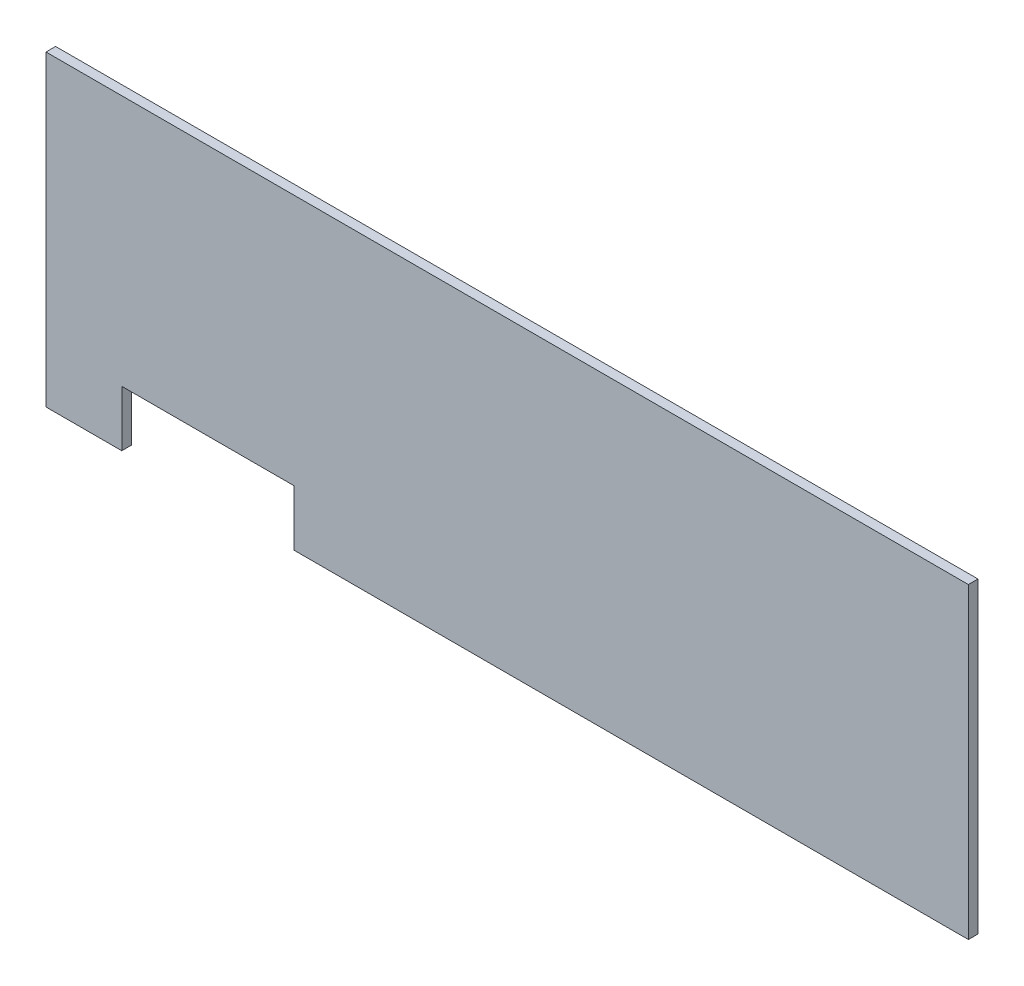
ISO-10303-21;
HEADER;
FILE_DESCRIPTION(('STEP AP214'),'2;1');
FILE_NAME('part.step','',(''),(''),'','','');
FILE_SCHEMA(('AUTOMOTIVE_DESIGN { 1 0 10303 214 1 1 1 1 }'));
ENDSEC;
DATA;
#1=APPLICATION_CONTEXT('core data for automotive mechanical design processes');
#2=APPLICATION_PROTOCOL_DEFINITION('international standard','automotive_design',2000,#1);
#3=PRODUCT_CONTEXT('',#1,'mechanical');
#4=PRODUCT('Part','Part','',(#3));
#5=PRODUCT_RELATED_PRODUCT_CATEGORY('part','',(#4));
#6=PRODUCT_DEFINITION_FORMATION('','',#4);
#7=PRODUCT_DEFINITION_CONTEXT('part definition',#1,'design');
#8=PRODUCT_DEFINITION('design','',#6,#7);
#9=PRODUCT_DEFINITION_SHAPE('','',#8);
#10=(LENGTH_UNIT() NAMED_UNIT(*) SI_UNIT(.MILLI.,.METRE.));
#11=(NAMED_UNIT(*) PLANE_ANGLE_UNIT() SI_UNIT($,.RADIAN.));
#12=(NAMED_UNIT(*) SI_UNIT($,.STERADIAN.) SOLID_ANGLE_UNIT());
#13=UNCERTAINTY_MEASURE_WITH_UNIT(LENGTH_MEASURE(1.E-05),#10,'distance_accuracy_value','');
#14=(GEOMETRIC_REPRESENTATION_CONTEXT(3) GLOBAL_UNCERTAINTY_ASSIGNED_CONTEXT((#13)) GLOBAL_UNIT_ASSIGNED_CONTEXT((#10,
#11,#12)) REPRESENTATION_CONTEXT('',''));
#15=CARTESIAN_POINT('',(0.,0.,0.));
#16=DIRECTION('',(0.,0.,1.));
#17=DIRECTION('',(1.,0.,0.));
#18=AXIS2_PLACEMENT_3D('',#15,#16,#17);
#19=CARTESIAN_POINT('',(152.4,-50.8,3.175));
#20=DIRECTION('',(-1.,0.,0.));
#21=DIRECTION('',(0.,0.,1.));
#22=AXIS2_PLACEMENT_3D('',#19,#20,#21);
#23=PLANE('',#22);
#24=DIRECTION('',(0.,1.,0.));
#25=VECTOR('',#24,1.);
#26=CARTESIAN_POINT('',(152.4,-50.8,0.));
#27=LINE('',#26,#25);
#28=CARTESIAN_POINT('',(152.4,-50.8,0.));
#29=VERTEX_POINT('',#28);
#30=CARTESIAN_POINT('',(152.4,50.8,0.));
#31=VERTEX_POINT('',#30);
#32=EDGE_CURVE('E129',#29,#31,#27,.T.);
#33=ORIENTED_EDGE('',*,*,#32,.T.);
#34=DIRECTION('',(0.,0.,-1.));
#35=VECTOR('',#34,1.);
#36=CARTESIAN_POINT('',(152.4,50.8,3.175));
#37=LINE('',#36,#35);
#38=CARTESIAN_POINT('',(152.4,50.8,3.175));
#39=VERTEX_POINT('',#38);
#40=EDGE_CURVE('E11',#39,#31,#37,.T.);
#41=ORIENTED_EDGE('',*,*,#40,.F.);
#42=DIRECTION('',(0.,1.,0.));
#43=VECTOR('',#42,1.);
#44=CARTESIAN_POINT('',(152.4,-50.8,3.175));
#45=LINE('',#44,#43);
#46=CARTESIAN_POINT('',(152.4,-50.8,3.175));
#47=VERTEX_POINT('',#46);
#48=EDGE_CURVE('E143',#47,#39,#45,.T.);
#49=ORIENTED_EDGE('',*,*,#48,.F.);
#50=DIRECTION('',(0.,0.,-1.));
#51=VECTOR('',#50,1.);
#52=CARTESIAN_POINT('',(152.4,-50.8,3.175));
#53=LINE('',#52,#51);
#54=EDGE_CURVE('E125',#47,#29,#53,.T.);
#55=ORIENTED_EDGE('',*,*,#54,.T.);
#56=EDGE_LOOP('',(#33,#41,#49,#55));
#57=FACE_BOUND('',#56,.T.);
#58=ADVANCED_FACE('F33',(#57),#23,.F.);
#59=CARTESIAN_POINT('',(-152.4,50.8,3.175));
#60=DIRECTION('',(0.,-1.,0.));
#61=DIRECTION('',(0.,0.,-1.));
#62=AXIS2_PLACEMENT_3D('',#59,#60,#61);
#63=PLANE('',#62);
#64=DIRECTION('',(-1.,0.,0.));
#65=VECTOR('',#64,1.);
#66=CARTESIAN_POINT('',(-152.4,50.8,0.));
#67=LINE('',#66,#65);
#68=CARTESIAN_POINT('',(-152.4,50.8,0.));
#69=VERTEX_POINT('',#68);
#70=EDGE_CURVE('E132',#31,#69,#67,.T.);
#71=ORIENTED_EDGE('',*,*,#70,.T.);
#72=DIRECTION('',(0.,0.,-1.));
#73=VECTOR('',#72,1.);
#74=CARTESIAN_POINT('',(-152.4,50.8,3.175));
#75=LINE('',#74,#73);
#76=CARTESIAN_POINT('',(-152.4,50.8,3.175));
#77=VERTEX_POINT('',#76);
#78=EDGE_CURVE('E41',#77,#69,#75,.T.);
#79=ORIENTED_EDGE('',*,*,#78,.F.);
#80=DIRECTION('',(-1.,0.,0.));
#81=VECTOR('',#80,1.);
#82=CARTESIAN_POINT('',(-152.4,50.8,3.175));
#83=LINE('',#82,#81);
#84=EDGE_CURVE('E92',#39,#77,#83,.T.);
#85=ORIENTED_EDGE('',*,*,#84,.F.);
#86=ORIENTED_EDGE('',*,*,#40,.T.);
#87=EDGE_LOOP('',(#71,#79,#85,#86));
#88=FACE_BOUND('',#87,.T.);
#89=ADVANCED_FACE('F178',(#88),#63,.F.);
#90=CARTESIAN_POINT('',(-152.4,-50.8,3.175));
#91=DIRECTION('',(1.,0.,0.));
#92=DIRECTION('',(0.,0.,-1.));
#93=AXIS2_PLACEMENT_3D('',#90,#91,#92);
#94=PLANE('',#93);
#95=DIRECTION('',(0.,-1.,0.));
#96=VECTOR('',#95,1.);
#97=CARTESIAN_POINT('',(-152.4,-50.8,0.));
#98=LINE('',#97,#96);
#99=CARTESIAN_POINT('',(-152.4,-50.8,0.));
#100=VERTEX_POINT('',#99);
#101=EDGE_CURVE('E134',#69,#100,#98,.T.);
#102=ORIENTED_EDGE('',*,*,#101,.T.);
#103=DIRECTION('',(0.,0.,-1.));
#104=VECTOR('',#103,1.);
#105=CARTESIAN_POINT('',(-152.4,-50.8,3.175));
#106=LINE('',#105,#104);
#107=CARTESIAN_POINT('',(-152.4,-50.8,3.175));
#108=VERTEX_POINT('',#107);
#109=EDGE_CURVE('E150',#108,#100,#106,.T.);
#110=ORIENTED_EDGE('',*,*,#109,.F.);
#111=DIRECTION('',(0.,-1.,0.));
#112=VECTOR('',#111,1.);
#113=CARTESIAN_POINT('',(-152.4,-50.8,3.175));
#114=LINE('',#113,#112);
#115=EDGE_CURVE('E158',#77,#108,#114,.T.);
#116=ORIENTED_EDGE('',*,*,#115,.F.);
#117=ORIENTED_EDGE('',*,*,#78,.T.);
#118=EDGE_LOOP('',(#102,#110,#116,#117));
#119=FACE_BOUND('',#118,.T.);
#120=ADVANCED_FACE('F156',(#119),#94,.F.);
#121=CARTESIAN_POINT('',(-152.4,-50.8,3.175));
#122=DIRECTION('',(0.,1.,0.));
#123=DIRECTION('',(0.,0.,1.));
#124=AXIS2_PLACEMENT_3D('',#121,#122,#123);
#125=PLANE('',#124);
#126=DIRECTION('',(1.,0.,0.));
#127=VECTOR('',#126,1.);
#128=CARTESIAN_POINT('',(-152.4,-50.8,0.));
#129=LINE('',#128,#127);
#130=CARTESIAN_POINT('',(-127.36284932908,-50.8,0.));
#131=VERTEX_POINT('',#130);
#132=EDGE_CURVE('E136',#100,#131,#129,.T.);
#133=ORIENTED_EDGE('',*,*,#132,.T.);
#134=DIRECTION('',(0.,0.,-1.));
#135=VECTOR('',#134,1.);
#136=CARTESIAN_POINT('',(-127.36284932908,-50.8,3.175));
#137=LINE('',#136,#135);
#138=CARTESIAN_POINT('',(-127.36284932908,-50.8,3.175));
#139=VERTEX_POINT('',#138);
#140=EDGE_CURVE('E147',#139,#131,#137,.T.);
#141=ORIENTED_EDGE('',*,*,#140,.F.);
#142=DIRECTION('',(1.,0.,0.));
#143=VECTOR('',#142,1.);
#144=CARTESIAN_POINT('',(-152.4,-50.8,3.175));
#145=LINE('',#144,#143);
#146=EDGE_CURVE('E170',#108,#139,#145,.T.);
#147=ORIENTED_EDGE('',*,*,#146,.F.);
#148=ORIENTED_EDGE('',*,*,#109,.T.);
#149=EDGE_LOOP('',(#133,#141,#147,#148));
#150=FACE_BOUND('',#149,.T.);
#151=ADVANCED_FACE('F166',(#150),#125,.F.);
#152=CARTESIAN_POINT('',(-127.36284932908,-50.8,3.175));
#153=DIRECTION('',(-1.,0.,0.));
#154=DIRECTION('',(0.,0.,1.));
#155=AXIS2_PLACEMENT_3D('',#152,#153,#154);
#156=PLANE('',#155);
#157=DIRECTION('',(0.,1.,0.));
#158=VECTOR('',#157,1.);
#159=CARTESIAN_POINT('',(-127.36284932908,-50.8,0.));
#160=LINE('',#159,#158);
#161=CARTESIAN_POINT('',(-127.36284932908,-32.348607659785,0.));
#162=VERTEX_POINT('',#161);
#163=EDGE_CURVE('E138',#131,#162,#160,.T.);
#164=ORIENTED_EDGE('',*,*,#163,.T.);
#165=DIRECTION('',(0.,0.,-1.));
#166=VECTOR('',#165,1.);
#167=CARTESIAN_POINT('',(-127.36284932908,-32.348607659785,3.175));
#168=LINE('',#167,#166);
#169=CARTESIAN_POINT('',(-127.36284932908,-32.348607659785,3.175));
#170=VERTEX_POINT('',#169);
#171=EDGE_CURVE('E120',#170,#162,#168,.T.);
#172=ORIENTED_EDGE('',*,*,#171,.F.);
#173=DIRECTION('',(0.,1.,0.));
#174=VECTOR('',#173,1.);
#175=CARTESIAN_POINT('',(-127.36284932908,-50.8,3.175));
#176=LINE('',#175,#174);
#177=EDGE_CURVE('E111',#139,#170,#176,.T.);
#178=ORIENTED_EDGE('',*,*,#177,.F.);
#179=ORIENTED_EDGE('',*,*,#140,.T.);
#180=EDGE_LOOP('',(#164,#172,#178,#179));
#181=FACE_BOUND('',#180,.T.);
#182=ADVANCED_FACE('F169',(#181),#156,.F.);
#183=CARTESIAN_POINT('',(-127.36284932908,-32.348607659785,3.175));
#184=DIRECTION('',(0.,1.,0.));
#185=DIRECTION('',(0.,0.,1.));
#186=AXIS2_PLACEMENT_3D('',#183,#184,#185);
#187=PLANE('',#186);
#188=DIRECTION('',(1.,0.,0.));
#189=VECTOR('',#188,1.);
#190=CARTESIAN_POINT('',(-127.36284932908,-32.348607659785,0.));
#191=LINE('',#190,#189);
#192=CARTESIAN_POINT('',(-70.4904972224677,-32.348607659785,0.));
#193=VERTEX_POINT('',#192);
#194=EDGE_CURVE('E119',#162,#193,#191,.T.);
#195=ORIENTED_EDGE('',*,*,#194,.T.);
#196=DIRECTION('',(0.,0.,-1.));
#197=VECTOR('',#196,1.);
#198=CARTESIAN_POINT('',(-70.4904972224677,-32.348607659785,3.175));
#199=LINE('',#198,#197);
#200=CARTESIAN_POINT('',(-70.4904972224677,-32.348607659785,3.175));
#201=VERTEX_POINT('',#200);
#202=EDGE_CURVE('E116',#201,#193,#199,.T.);
#203=ORIENTED_EDGE('',*,*,#202,.F.);
#204=DIRECTION('',(1.,0.,0.));
#205=VECTOR('',#204,1.);
#206=CARTESIAN_POINT('',(-127.36284932908,-32.348607659785,3.175));
#207=LINE('',#206,#205);
#208=EDGE_CURVE('E105',#170,#201,#207,.T.);
#209=ORIENTED_EDGE('',*,*,#208,.F.);
#210=ORIENTED_EDGE('',*,*,#171,.T.);
#211=EDGE_LOOP('',(#195,#203,#209,#210));
#212=FACE_BOUND('',#211,.T.);
#213=ADVANCED_FACE('F117',(#212),#187,.F.);
#214=CARTESIAN_POINT('',(-70.4904972224677,-50.8,3.175));
#215=DIRECTION('',(1.,0.,0.));
#216=DIRECTION('',(0.,0.,-1.));
#217=AXIS2_PLACEMENT_3D('',#214,#215,#216);
#218=PLANE('',#217);
#219=DIRECTION('',(0.,-1.,0.));
#220=VECTOR('',#219,1.);
#221=CARTESIAN_POINT('',(-70.4904972224677,-50.8,0.));
#222=LINE('',#221,#220);
#223=CARTESIAN_POINT('',(-70.4904972224677,-50.8,0.));
#224=VERTEX_POINT('',#223);
#225=EDGE_CURVE('E78',#193,#224,#222,.T.);
#226=ORIENTED_EDGE('',*,*,#225,.T.);
#227=DIRECTION('',(0.,0.,-1.));
#228=VECTOR('',#227,1.);
#229=CARTESIAN_POINT('',(-70.4904972224677,-50.8,3.175));
#230=LINE('',#229,#228);
#231=CARTESIAN_POINT('',(-70.4904972224677,-50.8,3.175));
#232=VERTEX_POINT('',#231);
#233=EDGE_CURVE('E121',#232,#224,#230,.T.);
#234=ORIENTED_EDGE('',*,*,#233,.F.);
#235=DIRECTION('',(0.,-1.,0.));
#236=VECTOR('',#235,1.);
#237=CARTESIAN_POINT('',(-70.4904972224677,-50.8,3.175));
#238=LINE('',#237,#236);
#239=EDGE_CURVE('E109',#201,#232,#238,.T.);
#240=ORIENTED_EDGE('',*,*,#239,.F.);
#241=ORIENTED_EDGE('',*,*,#202,.T.);
#242=EDGE_LOOP('',(#226,#234,#240,#241));
#243=FACE_BOUND('',#242,.T.);
#244=ADVANCED_FACE('F123',(#243),#218,.F.);
#245=CARTESIAN_POINT('',(-70.4904972224677,-50.8,3.175));
#246=DIRECTION('',(0.,1.,0.));
#247=DIRECTION('',(0.,0.,1.));
#248=AXIS2_PLACEMENT_3D('',#245,#246,#247);
#249=PLANE('',#248);
#250=DIRECTION('',(1.,0.,0.));
#251=VECTOR('',#250,1.);
#252=CARTESIAN_POINT('',(-70.4904972224677,-50.8,0.));
#253=LINE('',#252,#251);
#254=EDGE_CURVE('E84',#224,#29,#253,.T.);
#255=ORIENTED_EDGE('',*,*,#254,.T.);
#256=ORIENTED_EDGE('',*,*,#54,.F.);
#257=DIRECTION('',(1.,0.,0.));
#258=VECTOR('',#257,1.);
#259=CARTESIAN_POINT('',(-70.4904972224677,-50.8,3.175));
#260=LINE('',#259,#258);
#261=EDGE_CURVE('E49',#232,#47,#260,.T.);
#262=ORIENTED_EDGE('',*,*,#261,.F.);
#263=ORIENTED_EDGE('',*,*,#233,.T.);
#264=EDGE_LOOP('',(#255,#256,#262,#263));
#265=FACE_BOUND('',#264,.T.);
#266=ADVANCED_FACE('F194',(#265),#249,.F.);
#267=CARTESIAN_POINT('',(0.,0.,3.175));
#268=DIRECTION('',(0.,0.,-1.));
#269=DIRECTION('',(-1.,0.,0.));
#270=AXIS2_PLACEMENT_3D('',#267,#268,#269);
#271=PLANE('',#270);
#272=ORIENTED_EDGE('',*,*,#48,.T.);
#273=ORIENTED_EDGE('',*,*,#84,.T.);
#274=ORIENTED_EDGE('',*,*,#115,.T.);
#275=ORIENTED_EDGE('',*,*,#146,.T.);
#276=ORIENTED_EDGE('',*,*,#177,.T.);
#277=ORIENTED_EDGE('',*,*,#208,.T.);
#278=ORIENTED_EDGE('',*,*,#239,.T.);
#279=ORIENTED_EDGE('',*,*,#261,.T.);
#280=EDGE_LOOP('',(#272,#273,#274,#275,#276,#277,#278,#279));
#281=FACE_BOUND('',#280,.T.);
#282=ADVANCED_FACE('F107',(#281),#271,.F.);
#283=CARTESIAN_POINT('',(0.,0.,0.));
#284=DIRECTION('',(0.,0.,-1.));
#285=DIRECTION('',(-1.,0.,0.));
#286=AXIS2_PLACEMENT_3D('',#283,#284,#285);
#287=PLANE('',#286);
#288=ORIENTED_EDGE('',*,*,#32,.F.);
#289=ORIENTED_EDGE('',*,*,#254,.F.);
#290=ORIENTED_EDGE('',*,*,#225,.F.);
#291=ORIENTED_EDGE('',*,*,#194,.F.);
#292=ORIENTED_EDGE('',*,*,#163,.F.);
#293=ORIENTED_EDGE('',*,*,#132,.F.);
#294=ORIENTED_EDGE('',*,*,#101,.F.);
#295=ORIENTED_EDGE('',*,*,#70,.F.);
#296=EDGE_LOOP('',(#288,#289,#290,#291,#292,#293,#294,#295));
#297=FACE_BOUND('',#296,.T.);
#298=ADVANCED_FACE('F162',(#297),#287,.T.);
#299=CLOSED_SHELL('',(#58,#89,#120,#151,#182,#213,#244,#266,#282,#298));
#300=MANIFOLD_SOLID_BREP('B2',#299);
#301=ADVANCED_BREP_SHAPE_REPRESENTATION('',(#18,#300),#14);
#302=SHAPE_DEFINITION_REPRESENTATION(#9,#301);
ENDSEC;
END-ISO-10303-21;
